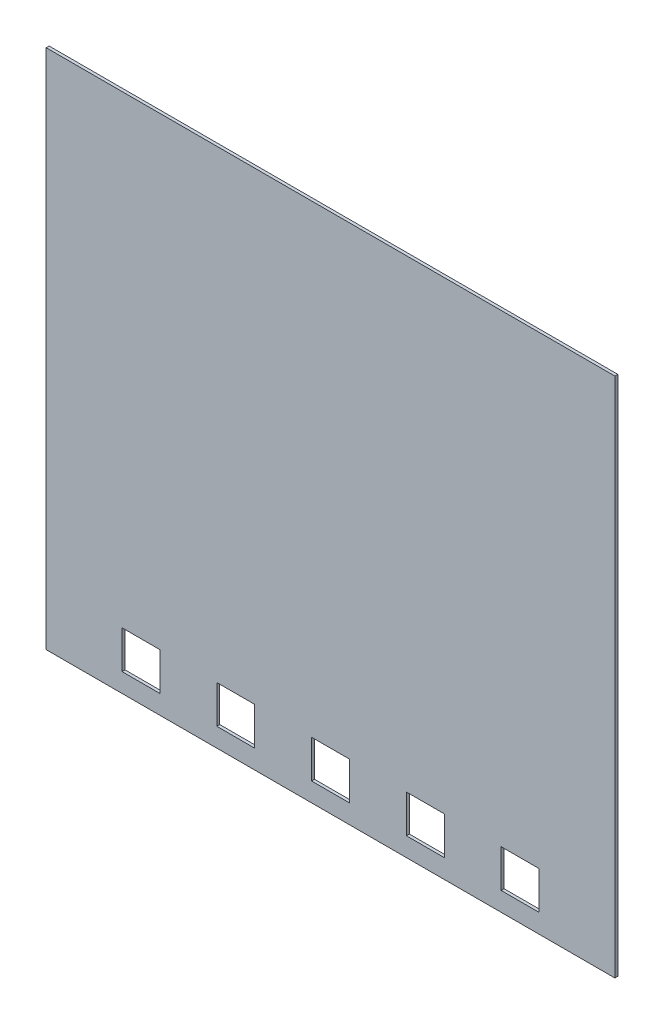
ISO-10303-21;
HEADER;
FILE_DESCRIPTION(('STEP AP214'),'2;1');
FILE_NAME('part.step','',(''),(''),'','','');
FILE_SCHEMA(('AUTOMOTIVE_DESIGN { 1 0 10303 214 1 1 1 1 }'));
ENDSEC;
DATA;
#1=APPLICATION_CONTEXT('core data for automotive mechanical design processes');
#2=APPLICATION_PROTOCOL_DEFINITION('international standard','automotive_design',2000,#1);
#3=PRODUCT_CONTEXT('',#1,'mechanical');
#4=PRODUCT('Part','Part','',(#3));
#5=PRODUCT_RELATED_PRODUCT_CATEGORY('part','',(#4));
#6=PRODUCT_DEFINITION_FORMATION('','',#4);
#7=PRODUCT_DEFINITION_CONTEXT('part definition',#1,'design');
#8=PRODUCT_DEFINITION('design','',#6,#7);
#9=PRODUCT_DEFINITION_SHAPE('','',#8);
#10=(LENGTH_UNIT() NAMED_UNIT(*) SI_UNIT(.MILLI.,.METRE.));
#11=(NAMED_UNIT(*) PLANE_ANGLE_UNIT() SI_UNIT($,.RADIAN.));
#12=(NAMED_UNIT(*) SI_UNIT($,.STERADIAN.) SOLID_ANGLE_UNIT());
#13=UNCERTAINTY_MEASURE_WITH_UNIT(LENGTH_MEASURE(1.E-05),#10,'distance_accuracy_value','');
#14=(GEOMETRIC_REPRESENTATION_CONTEXT(3) GLOBAL_UNCERTAINTY_ASSIGNED_CONTEXT((#13)) GLOBAL_UNIT_ASSIGNED_CONTEXT((#10,
#11,#12)) REPRESENTATION_CONTEXT('',''));
#15=CARTESIAN_POINT('',(0.,0.,0.));
#16=DIRECTION('',(0.,0.,1.));
#17=DIRECTION('',(1.,0.,0.));
#18=AXIS2_PLACEMENT_3D('',#15,#16,#17);
#19=CARTESIAN_POINT('',(0.,0.,0.396875));
#20=DIRECTION('',(-1.,0.,0.));
#21=DIRECTION('',(0.,-1.,0.));
#22=AXIS2_PLACEMENT_3D('',#19,#20,#21);
#23=PLANE('',#22);
#24=DIRECTION('',(0.,1.,0.));
#25=VECTOR('',#24,1.);
#26=CARTESIAN_POINT('',(0.,0.,0.));
#27=LINE('',#26,#25);
#28=CARTESIAN_POINT('',(0.,0.,0.));
#29=VERTEX_POINT('',#28);
#30=CARTESIAN_POINT('',(0.,69.85,0.));
#31=VERTEX_POINT('',#30);
#32=EDGE_CURVE('E236',#29,#31,#27,.T.);
#33=ORIENTED_EDGE('',*,*,#32,.T.);
#34=DIRECTION('',(0.,0.,-1.));
#35=VECTOR('',#34,1.);
#36=CARTESIAN_POINT('',(0.,69.85,0.396875));
#37=LINE('',#36,#35);
#38=CARTESIAN_POINT('',(0.,69.85,0.396875));
#39=VERTEX_POINT('',#38);
#40=EDGE_CURVE('E11',#39,#31,#37,.T.);
#41=ORIENTED_EDGE('',*,*,#40,.F.);
#42=DIRECTION('',(0.,1.,0.));
#43=VECTOR('',#42,1.);
#44=CARTESIAN_POINT('',(0.,0.,0.396875));
#45=LINE('',#44,#43);
#46=CARTESIAN_POINT('',(0.,0.,0.396875));
#47=VERTEX_POINT('',#46);
#48=EDGE_CURVE('E365',#47,#39,#45,.T.);
#49=ORIENTED_EDGE('',*,*,#48,.F.);
#50=DIRECTION('',(0.,0.,-1.));
#51=VECTOR('',#50,1.);
#52=CARTESIAN_POINT('',(0.,0.,0.396875));
#53=LINE('',#52,#51);
#54=EDGE_CURVE('E375',#47,#29,#53,.T.);
#55=ORIENTED_EDGE('',*,*,#54,.T.);
#56=EDGE_LOOP('',(#33,#41,#49,#55));
#57=FACE_BOUND('',#56,.T.);
#58=ADVANCED_FACE('F38',(#57),#23,.F.);
#59=CARTESIAN_POINT('',(0.,69.85,0.396875));
#60=DIRECTION('',(0.,-1.,0.));
#61=DIRECTION('',(1.,0.,0.));
#62=AXIS2_PLACEMENT_3D('',#59,#60,#61);
#63=PLANE('',#62);
#64=DIRECTION('',(-1.,0.,0.));
#65=VECTOR('',#64,1.);
#66=CARTESIAN_POINT('',(0.,69.85,0.));
#67=LINE('',#66,#65);
#68=CARTESIAN_POINT('',(-76.2,69.85,0.));
#69=VERTEX_POINT('',#68);
#70=EDGE_CURVE('E378',#31,#69,#67,.T.);
#71=ORIENTED_EDGE('',*,*,#70,.T.);
#72=DIRECTION('',(0.,0.,-1.));
#73=VECTOR('',#72,1.);
#74=CARTESIAN_POINT('',(-76.2,69.85,0.396875));
#75=LINE('',#74,#73);
#76=CARTESIAN_POINT('',(-76.2,69.85,0.396875));
#77=VERTEX_POINT('',#76);
#78=EDGE_CURVE('E45',#77,#69,#75,.T.);
#79=ORIENTED_EDGE('',*,*,#78,.F.);
#80=DIRECTION('',(-1.,0.,0.));
#81=VECTOR('',#80,1.);
#82=CARTESIAN_POINT('',(0.,69.85,0.396875));
#83=LINE('',#82,#81);
#84=EDGE_CURVE('E368',#39,#77,#83,.T.);
#85=ORIENTED_EDGE('',*,*,#84,.F.);
#86=ORIENTED_EDGE('',*,*,#40,.T.);
#87=EDGE_LOOP('',(#71,#79,#85,#86));
#88=FACE_BOUND('',#87,.T.);
#89=ADVANCED_FACE('F407',(#88),#63,.F.);
#90=CARTESIAN_POINT('',(-76.2,0.,0.396875));
#91=DIRECTION('',(1.,0.,0.));
#92=DIRECTION('',(0.,0.,-1.));
#93=AXIS2_PLACEMENT_3D('',#90,#91,#92);
#94=PLANE('',#93);
#95=DIRECTION('',(0.,-1.,0.));
#96=VECTOR('',#95,1.);
#97=CARTESIAN_POINT('',(-76.2,0.,0.));
#98=LINE('',#97,#96);
#99=CARTESIAN_POINT('',(-76.2,0.,0.));
#100=VERTEX_POINT('',#99);
#101=EDGE_CURVE('E380',#69,#100,#98,.T.);
#102=ORIENTED_EDGE('',*,*,#101,.T.);
#103=DIRECTION('',(0.,0.,-1.));
#104=VECTOR('',#103,1.);
#105=CARTESIAN_POINT('',(-76.2,0.,0.396875));
#106=LINE('',#105,#104);
#107=CARTESIAN_POINT('',(-76.2,0.,0.396875));
#108=VERTEX_POINT('',#107);
#109=EDGE_CURVE('E385',#108,#100,#106,.T.);
#110=ORIENTED_EDGE('',*,*,#109,.F.);
#111=DIRECTION('',(0.,-1.,0.));
#112=VECTOR('',#111,1.);
#113=CARTESIAN_POINT('',(-76.2,0.,0.396875));
#114=LINE('',#113,#112);
#115=EDGE_CURVE('E371',#77,#108,#114,.T.);
#116=ORIENTED_EDGE('',*,*,#115,.F.);
#117=ORIENTED_EDGE('',*,*,#78,.T.);
#118=EDGE_LOOP('',(#102,#110,#116,#117));
#119=FACE_BOUND('',#118,.T.);
#120=ADVANCED_FACE('F392',(#119),#94,.F.);
#121=CARTESIAN_POINT('',(0.,0.,0.396875));
#122=DIRECTION('',(0.,1.,0.));
#123=DIRECTION('',(0.,0.,1.));
#124=AXIS2_PLACEMENT_3D('',#121,#122,#123);
#125=PLANE('',#124);
#126=DIRECTION('',(1.,0.,0.));
#127=VECTOR('',#126,1.);
#128=CARTESIAN_POINT('',(0.,0.,0.));
#129=LINE('',#128,#127);
#130=EDGE_CURVE('E369',#100,#29,#129,.T.);
#131=ORIENTED_EDGE('',*,*,#130,.T.);
#132=ORIENTED_EDGE('',*,*,#54,.F.);
#133=DIRECTION('',(1.,0.,0.));
#134=VECTOR('',#133,1.);
#135=CARTESIAN_POINT('',(0.,0.,0.396875));
#136=LINE('',#135,#134);
#137=EDGE_CURVE('E373',#108,#47,#136,.T.);
#138=ORIENTED_EDGE('',*,*,#137,.F.);
#139=ORIENTED_EDGE('',*,*,#109,.T.);
#140=EDGE_LOOP('',(#131,#132,#138,#139));
#141=FACE_BOUND('',#140,.T.);
#142=ADVANCED_FACE('F401',(#141),#125,.F.);
#143=CARTESIAN_POINT('',(0.,0.,0.396875));
#144=DIRECTION('',(0.,0.,1.));
#145=DIRECTION('',(1.,0.,0.));
#146=AXIS2_PLACEMENT_3D('',#143,#144,#145);
#147=PLANE('',#146);
#148=DIRECTION('',(0.,1.,0.));
#149=VECTOR('',#148,1.);
#150=CARTESIAN_POINT('',(-66.04,2.54,0.396875));
#151=LINE('',#150,#149);
#152=CARTESIAN_POINT('',(-66.04,2.54,0.396875));
#153=VERTEX_POINT('',#152);
#154=CARTESIAN_POINT('',(-66.04,7.61999999999999,0.396875));
#155=VERTEX_POINT('',#154);
#156=EDGE_CURVE('E202',#153,#155,#151,.T.);
#157=ORIENTED_EDGE('',*,*,#156,.T.);
#158=DIRECTION('',(1.,0.,0.));
#159=VECTOR('',#158,1.);
#160=CARTESIAN_POINT('',(-66.04,7.61999999999999,0.396875));
#161=LINE('',#160,#159);
#162=CARTESIAN_POINT('',(-60.96,7.61999999999999,0.396875));
#163=VERTEX_POINT('',#162);
#164=EDGE_CURVE('E213',#155,#163,#161,.T.);
#165=ORIENTED_EDGE('',*,*,#164,.T.);
#166=DIRECTION('',(0.,-1.,0.));
#167=VECTOR('',#166,1.);
#168=CARTESIAN_POINT('',(-60.96,2.54,0.396875));
#169=LINE('',#168,#167);
#170=CARTESIAN_POINT('',(-60.96,2.54,0.396875));
#171=VERTEX_POINT('',#170);
#172=EDGE_CURVE('E52',#163,#171,#169,.T.);
#173=ORIENTED_EDGE('',*,*,#172,.T.);
#174=DIRECTION('',(-1.,0.,0.));
#175=VECTOR('',#174,1.);
#176=CARTESIAN_POINT('',(-66.04,2.54,0.396875));
#177=LINE('',#176,#175);
#178=EDGE_CURVE('E210',#171,#153,#177,.T.);
#179=ORIENTED_EDGE('',*,*,#178,.T.);
#180=EDGE_LOOP('',(#157,#165,#173,#179));
#181=FACE_BOUND('',#180,.T.);
#182=DIRECTION('',(0.,1.,0.));
#183=VECTOR('',#182,1.);
#184=CARTESIAN_POINT('',(-53.34,2.54,0.396875));
#185=LINE('',#184,#183);
#186=CARTESIAN_POINT('',(-53.34,2.54,0.396875));
#187=VERTEX_POINT('',#186);
#188=CARTESIAN_POINT('',(-53.34,7.61999999999999,0.396875));
#189=VERTEX_POINT('',#188);
#190=EDGE_CURVE('E240',#187,#189,#185,.T.);
#191=ORIENTED_EDGE('',*,*,#190,.T.);
#192=DIRECTION('',(1.,0.,0.));
#193=VECTOR('',#192,1.);
#194=CARTESIAN_POINT('',(-53.34,7.61999999999999,0.396875));
#195=LINE('',#194,#193);
#196=CARTESIAN_POINT('',(-48.26,7.61999999999999,0.396875));
#197=VERTEX_POINT('',#196);
#198=EDGE_CURVE('E243',#189,#197,#195,.T.);
#199=ORIENTED_EDGE('',*,*,#198,.T.);
#200=DIRECTION('',(0.,-1.,0.));
#201=VECTOR('',#200,1.);
#202=CARTESIAN_POINT('',(-48.26,2.54,0.396875));
#203=LINE('',#202,#201);
#204=CARTESIAN_POINT('',(-48.26,2.54,0.396875));
#205=VERTEX_POINT('',#204);
#206=EDGE_CURVE('E60',#197,#205,#203,.T.);
#207=ORIENTED_EDGE('',*,*,#206,.T.);
#208=DIRECTION('',(-1.,0.,0.));
#209=VECTOR('',#208,1.);
#210=CARTESIAN_POINT('',(-53.34,2.54,0.396875));
#211=LINE('',#210,#209);
#212=EDGE_CURVE('E248',#205,#187,#211,.T.);
#213=ORIENTED_EDGE('',*,*,#212,.T.);
#214=EDGE_LOOP('',(#191,#199,#207,#213));
#215=FACE_BOUND('',#214,.T.);
#216=DIRECTION('',(0.,1.,0.));
#217=VECTOR('',#216,1.);
#218=CARTESIAN_POINT('',(-40.64,2.54,0.396875));
#219=LINE('',#218,#217);
#220=CARTESIAN_POINT('',(-40.64,2.54,0.396875));
#221=VERTEX_POINT('',#220);
#222=CARTESIAN_POINT('',(-40.64,7.61999999999999,0.396875));
#223=VERTEX_POINT('',#222);
#224=EDGE_CURVE('E270',#221,#223,#219,.T.);
#225=ORIENTED_EDGE('',*,*,#224,.T.);
#226=DIRECTION('',(1.,0.,0.));
#227=VECTOR('',#226,1.);
#228=CARTESIAN_POINT('',(-40.64,7.61999999999999,0.396875));
#229=LINE('',#228,#227);
#230=CARTESIAN_POINT('',(-35.56,7.61999999999999,0.396875));
#231=VERTEX_POINT('',#230);
#232=EDGE_CURVE('E273',#223,#231,#229,.T.);
#233=ORIENTED_EDGE('',*,*,#232,.T.);
#234=DIRECTION('',(0.,-1.,0.));
#235=VECTOR('',#234,1.);
#236=CARTESIAN_POINT('',(-35.56,2.54,0.396875));
#237=LINE('',#236,#235);
#238=CARTESIAN_POINT('',(-35.56,2.54,0.396875));
#239=VERTEX_POINT('',#238);
#240=EDGE_CURVE('E277',#231,#239,#237,.T.);
#241=ORIENTED_EDGE('',*,*,#240,.T.);
#242=DIRECTION('',(-1.,0.,0.));
#243=VECTOR('',#242,1.);
#244=CARTESIAN_POINT('',(-40.64,2.54,0.396875));
#245=LINE('',#244,#243);
#246=EDGE_CURVE('E280',#239,#221,#245,.T.);
#247=ORIENTED_EDGE('',*,*,#246,.T.);
#248=EDGE_LOOP('',(#225,#233,#241,#247));
#249=FACE_BOUND('',#248,.T.);
#250=DIRECTION('',(0.,1.,0.));
#251=VECTOR('',#250,1.);
#252=CARTESIAN_POINT('',(-27.94,2.53999999999999,0.396875));
#253=LINE('',#252,#251);
#254=CARTESIAN_POINT('',(-27.94,2.53999999999999,0.396875));
#255=VERTEX_POINT('',#254);
#256=CARTESIAN_POINT('',(-27.94,7.61999999999999,0.396875));
#257=VERTEX_POINT('',#256);
#258=EDGE_CURVE('E302',#255,#257,#253,.T.);
#259=ORIENTED_EDGE('',*,*,#258,.T.);
#260=DIRECTION('',(1.,0.,0.));
#261=VECTOR('',#260,1.);
#262=CARTESIAN_POINT('',(-27.94,7.61999999999999,0.396875));
#263=LINE('',#262,#261);
#264=CARTESIAN_POINT('',(-22.86,7.61999999999999,0.396875));
#265=VERTEX_POINT('',#264);
#266=EDGE_CURVE('E305',#257,#265,#263,.T.);
#267=ORIENTED_EDGE('',*,*,#266,.T.);
#268=DIRECTION('',(0.,-1.,0.));
#269=VECTOR('',#268,1.);
#270=CARTESIAN_POINT('',(-22.86,2.53999999999999,0.396875));
#271=LINE('',#270,#269);
#272=CARTESIAN_POINT('',(-22.86,2.53999999999999,0.396875));
#273=VERTEX_POINT('',#272);
#274=EDGE_CURVE('E309',#265,#273,#271,.T.);
#275=ORIENTED_EDGE('',*,*,#274,.T.);
#276=DIRECTION('',(-1.,0.,0.));
#277=VECTOR('',#276,1.);
#278=CARTESIAN_POINT('',(-27.94,2.53999999999999,0.396875));
#279=LINE('',#278,#277);
#280=EDGE_CURVE('E312',#273,#255,#279,.T.);
#281=ORIENTED_EDGE('',*,*,#280,.T.);
#282=EDGE_LOOP('',(#259,#267,#275,#281));
#283=FACE_BOUND('',#282,.T.);
#284=DIRECTION('',(0.,1.,0.));
#285=VECTOR('',#284,1.);
#286=CARTESIAN_POINT('',(-15.24,2.53999999999999,0.396875));
#287=LINE('',#286,#285);
#288=CARTESIAN_POINT('',(-15.24,2.53999999999999,0.396875));
#289=VERTEX_POINT('',#288);
#290=CARTESIAN_POINT('',(-15.24,7.61999999999999,0.396875));
#291=VERTEX_POINT('',#290);
#292=EDGE_CURVE('E334',#289,#291,#287,.T.);
#293=ORIENTED_EDGE('',*,*,#292,.T.);
#294=DIRECTION('',(1.,0.,0.));
#295=VECTOR('',#294,1.);
#296=CARTESIAN_POINT('',(-15.24,7.61999999999999,0.396875));
#297=LINE('',#296,#295);
#298=CARTESIAN_POINT('',(-10.16,7.61999999999999,0.396875));
#299=VERTEX_POINT('',#298);
#300=EDGE_CURVE('E337',#291,#299,#297,.T.);
#301=ORIENTED_EDGE('',*,*,#300,.T.);
#302=DIRECTION('',(0.,-1.,0.));
#303=VECTOR('',#302,1.);
#304=CARTESIAN_POINT('',(-10.16,2.53999999999999,0.396875));
#305=LINE('',#304,#303);
#306=CARTESIAN_POINT('',(-10.16,2.53999999999999,0.396875));
#307=VERTEX_POINT('',#306);
#308=EDGE_CURVE('E341',#299,#307,#305,.T.);
#309=ORIENTED_EDGE('',*,*,#308,.T.);
#310=DIRECTION('',(-1.,0.,0.));
#311=VECTOR('',#310,1.);
#312=CARTESIAN_POINT('',(-15.24,2.53999999999999,0.396875));
#313=LINE('',#312,#311);
#314=EDGE_CURVE('E344',#307,#289,#313,.T.);
#315=ORIENTED_EDGE('',*,*,#314,.T.);
#316=EDGE_LOOP('',(#293,#301,#309,#315));
#317=FACE_BOUND('',#316,.T.);
#318=ORIENTED_EDGE('',*,*,#48,.T.);
#319=ORIENTED_EDGE('',*,*,#84,.T.);
#320=ORIENTED_EDGE('',*,*,#115,.T.);
#321=ORIENTED_EDGE('',*,*,#137,.T.);
#322=EDGE_LOOP('',(#318,#319,#320,#321));
#323=FACE_BOUND('',#322,.T.);
#324=ADVANCED_FACE('F217',(#181,#215,#249,#283,#317,#323),#147,.T.);
#325=CARTESIAN_POINT('',(0.,0.,0.));
#326=DIRECTION('',(0.,0.,1.));
#327=DIRECTION('',(1.,0.,0.));
#328=AXIS2_PLACEMENT_3D('',#325,#326,#327);
#329=PLANE('',#328);
#330=DIRECTION('',(1.,0.,0.));
#331=VECTOR('',#330,1.);
#332=CARTESIAN_POINT('',(-66.04,7.61999999999999,0.));
#333=LINE('',#332,#331);
#334=CARTESIAN_POINT('',(-66.04,7.61999999999999,0.));
#335=VERTEX_POINT('',#334);
#336=CARTESIAN_POINT('',(-60.96,7.61999999999999,0.));
#337=VERTEX_POINT('',#336);
#338=EDGE_CURVE('E229',#335,#337,#333,.T.);
#339=ORIENTED_EDGE('',*,*,#338,.F.);
#340=DIRECTION('',(0.,1.,0.));
#341=VECTOR('',#340,1.);
#342=CARTESIAN_POINT('',(-66.04,2.54,0.));
#343=LINE('',#342,#341);
#344=CARTESIAN_POINT('',(-66.04,2.54,0.));
#345=VERTEX_POINT('',#344);
#346=EDGE_CURVE('E205',#345,#335,#343,.T.);
#347=ORIENTED_EDGE('',*,*,#346,.F.);
#348=DIRECTION('',(-1.,0.,0.));
#349=VECTOR('',#348,1.);
#350=CARTESIAN_POINT('',(-66.04,2.54,0.));
#351=LINE('',#350,#349);
#352=CARTESIAN_POINT('',(-60.96,2.54,0.));
#353=VERTEX_POINT('',#352);
#354=EDGE_CURVE('E220',#353,#345,#351,.T.);
#355=ORIENTED_EDGE('',*,*,#354,.F.);
#356=DIRECTION('',(0.,-1.,0.));
#357=VECTOR('',#356,1.);
#358=CARTESIAN_POINT('',(-60.96,2.54,0.));
#359=LINE('',#358,#357);
#360=EDGE_CURVE('E223',#337,#353,#359,.T.);
#361=ORIENTED_EDGE('',*,*,#360,.F.);
#362=EDGE_LOOP('',(#339,#347,#355,#361));
#363=FACE_BOUND('',#362,.T.);
#364=DIRECTION('',(1.,0.,0.));
#365=VECTOR('',#364,1.);
#366=CARTESIAN_POINT('',(-53.34,7.61999999999999,0.));
#367=LINE('',#366,#365);
#368=CARTESIAN_POINT('',(-53.34,7.61999999999999,0.));
#369=VERTEX_POINT('',#368);
#370=CARTESIAN_POINT('',(-48.26,7.61999999999999,0.));
#371=VERTEX_POINT('',#370);
#372=EDGE_CURVE('E254',#369,#371,#367,.T.);
#373=ORIENTED_EDGE('',*,*,#372,.F.);
#374=DIRECTION('',(0.,1.,0.));
#375=VECTOR('',#374,1.);
#376=CARTESIAN_POINT('',(-53.34,2.54,0.));
#377=LINE('',#376,#375);
#378=CARTESIAN_POINT('',(-53.34,2.54,0.));
#379=VERTEX_POINT('',#378);
#380=EDGE_CURVE('E252',#379,#369,#377,.T.);
#381=ORIENTED_EDGE('',*,*,#380,.F.);
#382=DIRECTION('',(-1.,0.,0.));
#383=VECTOR('',#382,1.);
#384=CARTESIAN_POINT('',(-53.34,2.54,0.));
#385=LINE('',#384,#383);
#386=CARTESIAN_POINT('',(-48.26,2.54,0.));
#387=VERTEX_POINT('',#386);
#388=EDGE_CURVE('E244',#387,#379,#385,.T.);
#389=ORIENTED_EDGE('',*,*,#388,.F.);
#390=DIRECTION('',(0.,-1.,0.));
#391=VECTOR('',#390,1.);
#392=CARTESIAN_POINT('',(-48.26,2.54,0.));
#393=LINE('',#392,#391);
#394=EDGE_CURVE('E258',#371,#387,#393,.T.);
#395=ORIENTED_EDGE('',*,*,#394,.F.);
#396=EDGE_LOOP('',(#373,#381,#389,#395));
#397=FACE_BOUND('',#396,.T.);
#398=DIRECTION('',(1.,0.,0.));
#399=VECTOR('',#398,1.);
#400=CARTESIAN_POINT('',(-40.64,7.61999999999999,0.));
#401=LINE('',#400,#399);
#402=CARTESIAN_POINT('',(-40.64,7.61999999999999,0.));
#403=VERTEX_POINT('',#402);
#404=CARTESIAN_POINT('',(-35.56,7.61999999999999,0.));
#405=VERTEX_POINT('',#404);
#406=EDGE_CURVE('E286',#403,#405,#401,.T.);
#407=ORIENTED_EDGE('',*,*,#406,.F.);
#408=DIRECTION('',(0.,1.,0.));
#409=VECTOR('',#408,1.);
#410=CARTESIAN_POINT('',(-40.64,2.54,0.));
#411=LINE('',#410,#409);
#412=CARTESIAN_POINT('',(-40.64,2.54,0.));
#413=VERTEX_POINT('',#412);
#414=EDGE_CURVE('E284',#413,#403,#411,.T.);
#415=ORIENTED_EDGE('',*,*,#414,.F.);
#416=DIRECTION('',(-1.,0.,0.));
#417=VECTOR('',#416,1.);
#418=CARTESIAN_POINT('',(-40.64,2.54,0.));
#419=LINE('',#418,#417);
#420=CARTESIAN_POINT('',(-35.56,2.54,0.));
#421=VERTEX_POINT('',#420);
#422=EDGE_CURVE('E274',#421,#413,#419,.T.);
#423=ORIENTED_EDGE('',*,*,#422,.F.);
#424=DIRECTION('',(0.,-1.,0.));
#425=VECTOR('',#424,1.);
#426=CARTESIAN_POINT('',(-35.56,2.54,0.));
#427=LINE('',#426,#425);
#428=EDGE_CURVE('E290',#405,#421,#427,.T.);
#429=ORIENTED_EDGE('',*,*,#428,.F.);
#430=EDGE_LOOP('',(#407,#415,#423,#429));
#431=FACE_BOUND('',#430,.T.);
#432=DIRECTION('',(1.,0.,0.));
#433=VECTOR('',#432,1.);
#434=CARTESIAN_POINT('',(-27.94,7.61999999999999,0.));
#435=LINE('',#434,#433);
#436=CARTESIAN_POINT('',(-27.94,7.61999999999999,0.));
#437=VERTEX_POINT('',#436);
#438=CARTESIAN_POINT('',(-22.86,7.61999999999999,0.));
#439=VERTEX_POINT('',#438);
#440=EDGE_CURVE('E318',#437,#439,#435,.T.);
#441=ORIENTED_EDGE('',*,*,#440,.F.);
#442=DIRECTION('',(0.,1.,0.));
#443=VECTOR('',#442,1.);
#444=CARTESIAN_POINT('',(-27.94,2.53999999999999,0.));
#445=LINE('',#444,#443);
#446=CARTESIAN_POINT('',(-27.94,2.53999999999999,0.));
#447=VERTEX_POINT('',#446);
#448=EDGE_CURVE('E316',#447,#437,#445,.T.);
#449=ORIENTED_EDGE('',*,*,#448,.F.);
#450=DIRECTION('',(-1.,0.,0.));
#451=VECTOR('',#450,1.);
#452=CARTESIAN_POINT('',(-27.94,2.53999999999999,0.));
#453=LINE('',#452,#451);
#454=CARTESIAN_POINT('',(-22.86,2.53999999999999,0.));
#455=VERTEX_POINT('',#454);
#456=EDGE_CURVE('E306',#455,#447,#453,.T.);
#457=ORIENTED_EDGE('',*,*,#456,.F.);
#458=DIRECTION('',(0.,-1.,0.));
#459=VECTOR('',#458,1.);
#460=CARTESIAN_POINT('',(-22.86,2.53999999999999,0.));
#461=LINE('',#460,#459);
#462=EDGE_CURVE('E322',#439,#455,#461,.T.);
#463=ORIENTED_EDGE('',*,*,#462,.F.);
#464=EDGE_LOOP('',(#441,#449,#457,#463));
#465=FACE_BOUND('',#464,.T.);
#466=DIRECTION('',(1.,0.,0.));
#467=VECTOR('',#466,1.);
#468=CARTESIAN_POINT('',(-15.24,7.61999999999999,0.));
#469=LINE('',#468,#467);
#470=CARTESIAN_POINT('',(-15.24,7.61999999999999,0.));
#471=VERTEX_POINT('',#470);
#472=CARTESIAN_POINT('',(-10.16,7.61999999999999,0.));
#473=VERTEX_POINT('',#472);
#474=EDGE_CURVE('E350',#471,#473,#469,.T.);
#475=ORIENTED_EDGE('',*,*,#474,.F.);
#476=DIRECTION('',(0.,1.,0.));
#477=VECTOR('',#476,1.);
#478=CARTESIAN_POINT('',(-15.24,2.53999999999999,0.));
#479=LINE('',#478,#477);
#480=CARTESIAN_POINT('',(-15.24,2.53999999999999,0.));
#481=VERTEX_POINT('',#480);
#482=EDGE_CURVE('E348',#481,#471,#479,.T.);
#483=ORIENTED_EDGE('',*,*,#482,.F.);
#484=DIRECTION('',(-1.,0.,0.));
#485=VECTOR('',#484,1.);
#486=CARTESIAN_POINT('',(-15.24,2.53999999999999,0.));
#487=LINE('',#486,#485);
#488=CARTESIAN_POINT('',(-10.16,2.53999999999999,0.));
#489=VERTEX_POINT('',#488);
#490=EDGE_CURVE('E338',#489,#481,#487,.T.);
#491=ORIENTED_EDGE('',*,*,#490,.F.);
#492=DIRECTION('',(0.,-1.,0.));
#493=VECTOR('',#492,1.);
#494=CARTESIAN_POINT('',(-10.16,2.53999999999999,0.));
#495=LINE('',#494,#493);
#496=EDGE_CURVE('E353',#473,#489,#495,.T.);
#497=ORIENTED_EDGE('',*,*,#496,.F.);
#498=EDGE_LOOP('',(#475,#483,#491,#497));
#499=FACE_BOUND('',#498,.T.);
#500=ORIENTED_EDGE('',*,*,#32,.F.);
#501=ORIENTED_EDGE('',*,*,#130,.F.);
#502=ORIENTED_EDGE('',*,*,#101,.F.);
#503=ORIENTED_EDGE('',*,*,#70,.F.);
#504=EDGE_LOOP('',(#500,#501,#502,#503));
#505=FACE_BOUND('',#504,.T.);
#506=ADVANCED_FACE('F398',(#363,#397,#431,#465,#499,#505),#329,.F.);
#507=CARTESIAN_POINT('',(-15.24,2.53999999999999,0.396875));
#508=DIRECTION('',(-1.,0.,0.));
#509=DIRECTION('',(0.,0.,1.));
#510=AXIS2_PLACEMENT_3D('',#507,#508,#509);
#511=PLANE('',#510);
#512=ORIENTED_EDGE('',*,*,#482,.T.);
#513=DIRECTION('',(0.,0.,-1.));
#514=VECTOR('',#513,1.);
#515=CARTESIAN_POINT('',(-15.24,7.61999999999999,0.396875));
#516=LINE('',#515,#514);
#517=EDGE_CURVE('E347',#291,#471,#516,.T.);
#518=ORIENTED_EDGE('',*,*,#517,.F.);
#519=ORIENTED_EDGE('',*,*,#292,.F.);
#520=DIRECTION('',(0.,0.,-1.));
#521=VECTOR('',#520,1.);
#522=CARTESIAN_POINT('',(-15.24,2.53999999999999,0.396875));
#523=LINE('',#522,#521);
#524=EDGE_CURVE('E319',#289,#481,#523,.T.);
#525=ORIENTED_EDGE('',*,*,#524,.T.);
#526=EDGE_LOOP('',(#512,#518,#519,#525));
#527=FACE_BOUND('',#526,.T.);
#528=ADVANCED_FACE('F419',(#527),#511,.F.);
#529=CARTESIAN_POINT('',(-15.24,2.53999999999999,0.396875));
#530=DIRECTION('',(0.,-1.,0.));
#531=DIRECTION('',(1.,0.,0.));
#532=AXIS2_PLACEMENT_3D('',#529,#530,#531);
#533=PLANE('',#532);
#534=ORIENTED_EDGE('',*,*,#490,.T.);
#535=ORIENTED_EDGE('',*,*,#524,.F.);
#536=ORIENTED_EDGE('',*,*,#314,.F.);
#537=DIRECTION('',(0.,0.,-1.));
#538=VECTOR('',#537,1.);
#539=CARTESIAN_POINT('',(-10.16,2.53999999999999,0.396875));
#540=LINE('',#539,#538);
#541=EDGE_CURVE('E359',#307,#489,#540,.T.);
#542=ORIENTED_EDGE('',*,*,#541,.T.);
#543=EDGE_LOOP('',(#534,#535,#536,#542));
#544=FACE_BOUND('',#543,.T.);
#545=ADVANCED_FACE('F425',(#544),#533,.F.);
#546=CARTESIAN_POINT('',(-10.16,2.53999999999999,0.396875));
#547=DIRECTION('',(1.,0.,0.));
#548=DIRECTION('',(0.,0.,-1.));
#549=AXIS2_PLACEMENT_3D('',#546,#547,#548);
#550=PLANE('',#549);
#551=ORIENTED_EDGE('',*,*,#496,.T.);
#552=ORIENTED_EDGE('',*,*,#541,.F.);
#553=ORIENTED_EDGE('',*,*,#308,.F.);
#554=DIRECTION('',(0.,0.,-1.));
#555=VECTOR('',#554,1.);
#556=CARTESIAN_POINT('',(-10.16,7.61999999999999,0.396875));
#557=LINE('',#556,#555);
#558=EDGE_CURVE('E361',#299,#473,#557,.T.);
#559=ORIENTED_EDGE('',*,*,#558,.T.);
#560=EDGE_LOOP('',(#551,#552,#553,#559));
#561=FACE_BOUND('',#560,.T.);
#562=ADVANCED_FACE('F431',(#561),#550,.F.);
#563=CARTESIAN_POINT('',(-15.24,7.61999999999999,0.396875));
#564=DIRECTION('',(0.,1.,0.));
#565=DIRECTION('',(0.,0.,1.));
#566=AXIS2_PLACEMENT_3D('',#563,#564,#565);
#567=PLANE('',#566);
#568=ORIENTED_EDGE('',*,*,#474,.T.);
#569=ORIENTED_EDGE('',*,*,#558,.F.);
#570=ORIENTED_EDGE('',*,*,#300,.F.);
#571=ORIENTED_EDGE('',*,*,#517,.T.);
#572=EDGE_LOOP('',(#568,#569,#570,#571));
#573=FACE_BOUND('',#572,.T.);
#574=ADVANCED_FACE('F427',(#573),#567,.F.);
#575=CARTESIAN_POINT('',(-27.94,2.53999999999999,0.396875));
#576=DIRECTION('',(-1.,0.,0.));
#577=DIRECTION('',(0.,0.,1.));
#578=AXIS2_PLACEMENT_3D('',#575,#576,#577);
#579=PLANE('',#578);
#580=ORIENTED_EDGE('',*,*,#448,.T.);
#581=DIRECTION('',(0.,0.,-1.));
#582=VECTOR('',#581,1.);
#583=CARTESIAN_POINT('',(-27.94,7.61999999999999,0.396875));
#584=LINE('',#583,#582);
#585=EDGE_CURVE('E315',#257,#437,#584,.T.);
#586=ORIENTED_EDGE('',*,*,#585,.F.);
#587=ORIENTED_EDGE('',*,*,#258,.F.);
#588=DIRECTION('',(0.,0.,-1.));
#589=VECTOR('',#588,1.);
#590=CARTESIAN_POINT('',(-27.94,2.53999999999999,0.396875));
#591=LINE('',#590,#589);
#592=EDGE_CURVE('E287',#255,#447,#591,.T.);
#593=ORIENTED_EDGE('',*,*,#592,.T.);
#594=EDGE_LOOP('',(#580,#586,#587,#593));
#595=FACE_BOUND('',#594,.T.);
#596=ADVANCED_FACE('F430',(#595),#579,.F.);
#597=CARTESIAN_POINT('',(-27.94,2.53999999999999,0.396875));
#598=DIRECTION('',(0.,-1.,0.));
#599=DIRECTION('',(1.,0.,0.));
#600=AXIS2_PLACEMENT_3D('',#597,#598,#599);
#601=PLANE('',#600);
#602=ORIENTED_EDGE('',*,*,#456,.T.);
#603=ORIENTED_EDGE('',*,*,#592,.F.);
#604=ORIENTED_EDGE('',*,*,#280,.F.);
#605=DIRECTION('',(0.,0.,-1.));
#606=VECTOR('',#605,1.);
#607=CARTESIAN_POINT('',(-22.86,2.53999999999999,0.396875));
#608=LINE('',#607,#606);
#609=EDGE_CURVE('E328',#273,#455,#608,.T.);
#610=ORIENTED_EDGE('',*,*,#609,.T.);
#611=EDGE_LOOP('',(#602,#603,#604,#610));
#612=FACE_BOUND('',#611,.T.);
#613=ADVANCED_FACE('F441',(#612),#601,.F.);
#614=CARTESIAN_POINT('',(-22.86,2.53999999999999,0.396875));
#615=DIRECTION('',(1.,0.,0.));
#616=DIRECTION('',(0.,0.,-1.));
#617=AXIS2_PLACEMENT_3D('',#614,#615,#616);
#618=PLANE('',#617);
#619=ORIENTED_EDGE('',*,*,#462,.T.);
#620=ORIENTED_EDGE('',*,*,#609,.F.);
#621=ORIENTED_EDGE('',*,*,#274,.F.);
#622=DIRECTION('',(0.,0.,-1.));
#623=VECTOR('',#622,1.);
#624=CARTESIAN_POINT('',(-22.86,7.61999999999999,0.396875));
#625=LINE('',#624,#623);
#626=EDGE_CURVE('E330',#265,#439,#625,.T.);
#627=ORIENTED_EDGE('',*,*,#626,.T.);
#628=EDGE_LOOP('',(#619,#620,#621,#627));
#629=FACE_BOUND('',#628,.T.);
#630=ADVANCED_FACE('F447',(#629),#618,.F.);
#631=CARTESIAN_POINT('',(-27.94,7.61999999999999,0.396875));
#632=DIRECTION('',(0.,1.,0.));
#633=DIRECTION('',(-1.,0.,0.));
#634=AXIS2_PLACEMENT_3D('',#631,#632,#633);
#635=PLANE('',#634);
#636=ORIENTED_EDGE('',*,*,#440,.T.);
#637=ORIENTED_EDGE('',*,*,#626,.F.);
#638=ORIENTED_EDGE('',*,*,#266,.F.);
#639=ORIENTED_EDGE('',*,*,#585,.T.);
#640=EDGE_LOOP('',(#636,#637,#638,#639));
#641=FACE_BOUND('',#640,.T.);
#642=ADVANCED_FACE('F443',(#641),#635,.F.);
#643=CARTESIAN_POINT('',(-40.64,2.54,0.396875));
#644=DIRECTION('',(-1.,0.,0.));
#645=DIRECTION('',(0.,0.,1.));
#646=AXIS2_PLACEMENT_3D('',#643,#644,#645);
#647=PLANE('',#646);
#648=ORIENTED_EDGE('',*,*,#414,.T.);
#649=DIRECTION('',(0.,0.,-1.));
#650=VECTOR('',#649,1.);
#651=CARTESIAN_POINT('',(-40.64,7.61999999999999,0.396875));
#652=LINE('',#651,#650);
#653=EDGE_CURVE('E283',#223,#403,#652,.T.);
#654=ORIENTED_EDGE('',*,*,#653,.F.);
#655=ORIENTED_EDGE('',*,*,#224,.F.);
#656=DIRECTION('',(0.,0.,-1.));
#657=VECTOR('',#656,1.);
#658=CARTESIAN_POINT('',(-40.64,2.54,0.396875));
#659=LINE('',#658,#657);
#660=EDGE_CURVE('E255',#221,#413,#659,.T.);
#661=ORIENTED_EDGE('',*,*,#660,.T.);
#662=EDGE_LOOP('',(#648,#654,#655,#661));
#663=FACE_BOUND('',#662,.T.);
#664=ADVANCED_FACE('F446',(#663),#647,.F.);
#665=CARTESIAN_POINT('',(-40.64,2.54,0.396875));
#666=DIRECTION('',(0.,-1.,0.));
#667=DIRECTION('',(0.,0.,-1.));
#668=AXIS2_PLACEMENT_3D('',#665,#666,#667);
#669=PLANE('',#668);
#670=ORIENTED_EDGE('',*,*,#422,.T.);
#671=ORIENTED_EDGE('',*,*,#660,.F.);
#672=ORIENTED_EDGE('',*,*,#246,.F.);
#673=DIRECTION('',(0.,0.,-1.));
#674=VECTOR('',#673,1.);
#675=CARTESIAN_POINT('',(-35.56,2.54,0.396875));
#676=LINE('',#675,#674);
#677=EDGE_CURVE('E296',#239,#421,#676,.T.);
#678=ORIENTED_EDGE('',*,*,#677,.T.);
#679=EDGE_LOOP('',(#670,#671,#672,#678));
#680=FACE_BOUND('',#679,.T.);
#681=ADVANCED_FACE('F457',(#680),#669,.F.);
#682=CARTESIAN_POINT('',(-35.56,2.54,0.396875));
#683=DIRECTION('',(1.,0.,0.));
#684=DIRECTION('',(0.,0.,-1.));
#685=AXIS2_PLACEMENT_3D('',#682,#683,#684);
#686=PLANE('',#685);
#687=ORIENTED_EDGE('',*,*,#428,.T.);
#688=ORIENTED_EDGE('',*,*,#677,.F.);
#689=ORIENTED_EDGE('',*,*,#240,.F.);
#690=DIRECTION('',(0.,0.,-1.));
#691=VECTOR('',#690,1.);
#692=CARTESIAN_POINT('',(-35.56,7.61999999999999,0.396875));
#693=LINE('',#692,#691);
#694=EDGE_CURVE('E298',#231,#405,#693,.T.);
#695=ORIENTED_EDGE('',*,*,#694,.T.);
#696=EDGE_LOOP('',(#687,#688,#689,#695));
#697=FACE_BOUND('',#696,.T.);
#698=ADVANCED_FACE('F463',(#697),#686,.F.);
#699=CARTESIAN_POINT('',(-40.64,7.61999999999999,0.396875));
#700=DIRECTION('',(0.,1.,0.));
#701=DIRECTION('',(0.,0.,1.));
#702=AXIS2_PLACEMENT_3D('',#699,#700,#701);
#703=PLANE('',#702);
#704=ORIENTED_EDGE('',*,*,#406,.T.);
#705=ORIENTED_EDGE('',*,*,#694,.F.);
#706=ORIENTED_EDGE('',*,*,#232,.F.);
#707=ORIENTED_EDGE('',*,*,#653,.T.);
#708=EDGE_LOOP('',(#704,#705,#706,#707));
#709=FACE_BOUND('',#708,.T.);
#710=ADVANCED_FACE('F459',(#709),#703,.F.);
#711=CARTESIAN_POINT('',(-53.34,2.54,0.396875));
#712=DIRECTION('',(-1.,0.,0.));
#713=DIRECTION('',(0.,0.,1.));
#714=AXIS2_PLACEMENT_3D('',#711,#712,#713);
#715=PLANE('',#714);
#716=ORIENTED_EDGE('',*,*,#380,.T.);
#717=DIRECTION('',(0.,0.,-1.));
#718=VECTOR('',#717,1.);
#719=CARTESIAN_POINT('',(-53.34,7.61999999999999,0.396875));
#720=LINE('',#719,#718);
#721=EDGE_CURVE('E251',#189,#369,#720,.T.);
#722=ORIENTED_EDGE('',*,*,#721,.F.);
#723=ORIENTED_EDGE('',*,*,#190,.F.);
#724=DIRECTION('',(0.,0.,-1.));
#725=VECTOR('',#724,1.);
#726=CARTESIAN_POINT('',(-53.34,2.54,0.396875));
#727=LINE('',#726,#725);
#728=EDGE_CURVE('E230',#187,#379,#727,.T.);
#729=ORIENTED_EDGE('',*,*,#728,.T.);
#730=EDGE_LOOP('',(#716,#722,#723,#729));
#731=FACE_BOUND('',#730,.T.);
#732=ADVANCED_FACE('F462',(#731),#715,.F.);
#733=CARTESIAN_POINT('',(-53.34,2.54,0.396875));
#734=DIRECTION('',(0.,-1.,0.));
#735=DIRECTION('',(0.,0.,-1.));
#736=AXIS2_PLACEMENT_3D('',#733,#734,#735);
#737=PLANE('',#736);
#738=ORIENTED_EDGE('',*,*,#388,.T.);
#739=ORIENTED_EDGE('',*,*,#728,.F.);
#740=ORIENTED_EDGE('',*,*,#212,.F.);
#741=DIRECTION('',(0.,0.,-1.));
#742=VECTOR('',#741,1.);
#743=CARTESIAN_POINT('',(-48.26,2.54,0.396875));
#744=LINE('',#743,#742);
#745=EDGE_CURVE('E264',#205,#387,#744,.T.);
#746=ORIENTED_EDGE('',*,*,#745,.T.);
#747=EDGE_LOOP('',(#738,#739,#740,#746));
#748=FACE_BOUND('',#747,.T.);
#749=ADVANCED_FACE('F473',(#748),#737,.F.);
#750=CARTESIAN_POINT('',(-48.26,2.54,0.396875));
#751=DIRECTION('',(1.,0.,0.));
#752=DIRECTION('',(0.,0.,-1.));
#753=AXIS2_PLACEMENT_3D('',#750,#751,#752);
#754=PLANE('',#753);
#755=ORIENTED_EDGE('',*,*,#394,.T.);
#756=ORIENTED_EDGE('',*,*,#745,.F.);
#757=ORIENTED_EDGE('',*,*,#206,.F.);
#758=DIRECTION('',(0.,0.,-1.));
#759=VECTOR('',#758,1.);
#760=CARTESIAN_POINT('',(-48.26,7.61999999999999,0.396875));
#761=LINE('',#760,#759);
#762=EDGE_CURVE('E266',#197,#371,#761,.T.);
#763=ORIENTED_EDGE('',*,*,#762,.T.);
#764=EDGE_LOOP('',(#755,#756,#757,#763));
#765=FACE_BOUND('',#764,.T.);
#766=ADVANCED_FACE('F478',(#765),#754,.F.);
#767=CARTESIAN_POINT('',(-53.34,7.61999999999999,0.396875));
#768=DIRECTION('',(0.,1.,0.));
#769=DIRECTION('',(-1.,0.,0.));
#770=AXIS2_PLACEMENT_3D('',#767,#768,#769);
#771=PLANE('',#770);
#772=ORIENTED_EDGE('',*,*,#372,.T.);
#773=ORIENTED_EDGE('',*,*,#762,.F.);
#774=ORIENTED_EDGE('',*,*,#198,.F.);
#775=ORIENTED_EDGE('',*,*,#721,.T.);
#776=EDGE_LOOP('',(#772,#773,#774,#775));
#777=FACE_BOUND('',#776,.T.);
#778=ADVANCED_FACE('F475',(#777),#771,.F.);
#779=CARTESIAN_POINT('',(-66.04,2.54,0.396875));
#780=DIRECTION('',(-1.,0.,0.));
#781=DIRECTION('',(0.,-1.,0.));
#782=AXIS2_PLACEMENT_3D('',#779,#780,#781);
#783=PLANE('',#782);
#784=ORIENTED_EDGE('',*,*,#346,.T.);
#785=DIRECTION('',(0.,0.,-1.));
#786=VECTOR('',#785,1.);
#787=CARTESIAN_POINT('',(-66.04,7.61999999999999,0.396875));
#788=LINE('',#787,#786);
#789=EDGE_CURVE('E198',#155,#335,#788,.T.);
#790=ORIENTED_EDGE('',*,*,#789,.F.);
#791=ORIENTED_EDGE('',*,*,#156,.F.);
#792=DIRECTION('',(0.,0.,-1.));
#793=VECTOR('',#792,1.);
#794=CARTESIAN_POINT('',(-66.04,2.54,0.396875));
#795=LINE('',#794,#793);
#796=EDGE_CURVE('E234',#153,#345,#795,.T.);
#797=ORIENTED_EDGE('',*,*,#796,.T.);
#798=EDGE_LOOP('',(#784,#790,#791,#797));
#799=FACE_BOUND('',#798,.T.);
#800=ADVANCED_FACE('F200',(#799),#783,.F.);
#801=CARTESIAN_POINT('',(-66.04,2.54,0.396875));
#802=DIRECTION('',(0.,-1.,0.));
#803=DIRECTION('',(1.,0.,0.));
#804=AXIS2_PLACEMENT_3D('',#801,#802,#803);
#805=PLANE('',#804);
#806=ORIENTED_EDGE('',*,*,#354,.T.);
#807=ORIENTED_EDGE('',*,*,#796,.F.);
#808=ORIENTED_EDGE('',*,*,#178,.F.);
#809=DIRECTION('',(0.,0.,-1.));
#810=VECTOR('',#809,1.);
#811=CARTESIAN_POINT('',(-60.96,2.54,0.396875));
#812=LINE('',#811,#810);
#813=EDGE_CURVE('E237',#171,#353,#812,.T.);
#814=ORIENTED_EDGE('',*,*,#813,.T.);
#815=EDGE_LOOP('',(#806,#807,#808,#814));
#816=FACE_BOUND('',#815,.T.);
#817=ADVANCED_FACE('F487',(#816),#805,.F.);
#818=CARTESIAN_POINT('',(-60.96,2.54,0.396875));
#819=DIRECTION('',(1.,0.,0.));
#820=DIRECTION('',(0.,0.,-1.));
#821=AXIS2_PLACEMENT_3D('',#818,#819,#820);
#822=PLANE('',#821);
#823=ORIENTED_EDGE('',*,*,#360,.T.);
#824=ORIENTED_EDGE('',*,*,#813,.F.);
#825=ORIENTED_EDGE('',*,*,#172,.F.);
#826=DIRECTION('',(0.,0.,-1.));
#827=VECTOR('',#826,1.);
#828=CARTESIAN_POINT('',(-60.96,7.61999999999999,0.396875));
#829=LINE('',#828,#827);
#830=EDGE_CURVE('E209',#163,#337,#829,.T.);
#831=ORIENTED_EDGE('',*,*,#830,.T.);
#832=EDGE_LOOP('',(#823,#824,#825,#831));
#833=FACE_BOUND('',#832,.T.);
#834=ADVANCED_FACE('F490',(#833),#822,.F.);
#835=CARTESIAN_POINT('',(-66.04,7.61999999999999,0.396875));
#836=DIRECTION('',(0.,1.,0.));
#837=DIRECTION('',(-1.,0.,0.));
#838=AXIS2_PLACEMENT_3D('',#835,#836,#837);
#839=PLANE('',#838);
#840=ORIENTED_EDGE('',*,*,#338,.T.);
#841=ORIENTED_EDGE('',*,*,#830,.F.);
#842=ORIENTED_EDGE('',*,*,#164,.F.);
#843=ORIENTED_EDGE('',*,*,#789,.T.);
#844=EDGE_LOOP('',(#840,#841,#842,#843));
#845=FACE_BOUND('',#844,.T.);
#846=ADVANCED_FACE('F214',(#845),#839,.F.);
#847=CLOSED_SHELL('',(#58,#89,#120,#142,#324,#506,#528,#545,#562,#574,#596,#613,#630,#642,#664,
#681,#698,#710,#732,#749,#766,#778,#800,#817,#834,#846));
#848=MANIFOLD_SOLID_BREP('B2',#847);
#849=ADVANCED_BREP_SHAPE_REPRESENTATION('',(#18,#848),#14);
#850=SHAPE_DEFINITION_REPRESENTATION(#9,#849);
ENDSEC;
END-ISO-10303-21;
